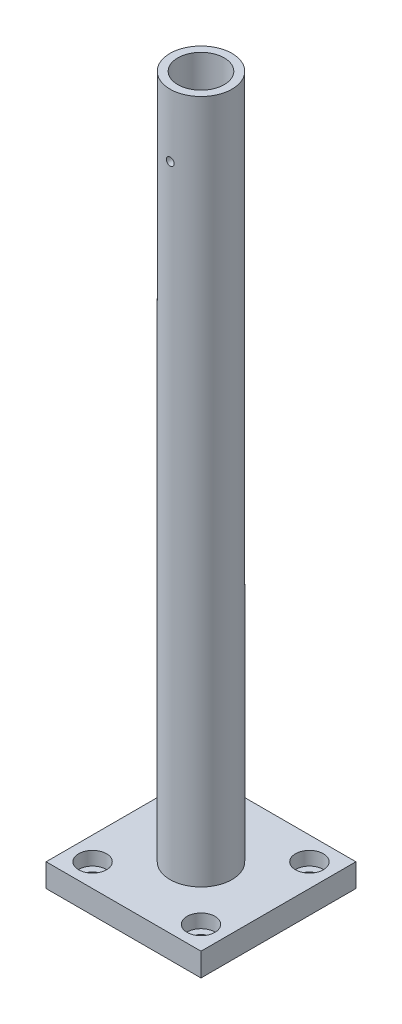
ISO-10303-21;
HEADER;
FILE_DESCRIPTION(('STEP AP214'),'2;1');
FILE_NAME('part.step','',(''),(''),'','','');
FILE_SCHEMA(('AUTOMOTIVE_DESIGN { 1 0 10303 214 1 1 1 1 }'));
ENDSEC;
DATA;
#1=APPLICATION_CONTEXT('core data for automotive mechanical design processes');
#2=APPLICATION_PROTOCOL_DEFINITION('international standard','automotive_design',2000,#1);
#3=PRODUCT_CONTEXT('',#1,'mechanical');
#4=PRODUCT('Part','Part','',(#3));
#5=PRODUCT_RELATED_PRODUCT_CATEGORY('part','',(#4));
#6=PRODUCT_DEFINITION_FORMATION('','',#4);
#7=PRODUCT_DEFINITION_CONTEXT('part definition',#1,'design');
#8=PRODUCT_DEFINITION('design','',#6,#7);
#9=PRODUCT_DEFINITION_SHAPE('','',#8);
#10=(LENGTH_UNIT() NAMED_UNIT(*) SI_UNIT(.MILLI.,.METRE.));
#11=(NAMED_UNIT(*) PLANE_ANGLE_UNIT() SI_UNIT($,.RADIAN.));
#12=(NAMED_UNIT(*) SI_UNIT($,.STERADIAN.) SOLID_ANGLE_UNIT());
#13=UNCERTAINTY_MEASURE_WITH_UNIT(LENGTH_MEASURE(1.E-05),#10,'distance_accuracy_value','');
#14=(GEOMETRIC_REPRESENTATION_CONTEXT(3) GLOBAL_UNCERTAINTY_ASSIGNED_CONTEXT((#13)) GLOBAL_UNIT_ASSIGNED_CONTEXT((#10,
#11,#12)) REPRESENTATION_CONTEXT('',''));
#15=CARTESIAN_POINT('',(0.,0.,0.));
#16=DIRECTION('',(0.,0.,1.));
#17=DIRECTION('',(1.,0.,0.));
#18=AXIS2_PLACEMENT_3D('',#15,#16,#17);
#19=CARTESIAN_POINT('',(15.,-319.,-85.));
#20=DIRECTION('',(0.,1.,0.));
#21=DIRECTION('',(0.,0.,1.));
#22=AXIS2_PLACEMENT_3D('',#19,#20,#21);
#23=CYLINDRICAL_SURFACE('',#22,4.50000000000001);
#24=CARTESIAN_POINT('',(15.,0.,-85.));
#25=DIRECTION('',(0.,-1.,0.));
#26=DIRECTION('',(0.,0.,-1.));
#27=AXIS2_PLACEMENT_3D('',#24,#25,#26);
#28=CIRCLE('',#27,4.50000000000001);
#29=CARTESIAN_POINT('',(15.,0.,-89.5));
#30=VERTEX_POINT('',#29);
#31=EDGE_CURVE('E199',#30,#30,#28,.T.);
#32=ORIENTED_EDGE('',*,*,#31,.T.);
#33=EDGE_LOOP('',(#32));
#34=FACE_BOUND('',#33,.T.);
#35=CARTESIAN_POINT('',(15.,6.19999999999998,-85.));
#36=DIRECTION('',(0.,1.,0.));
#37=DIRECTION('',(0.,0.,1.));
#38=AXIS2_PLACEMENT_3D('',#35,#36,#37);
#39=CIRCLE('',#38,4.50000000000001);
#40=CARTESIAN_POINT('',(15.,6.19999999999998,-80.5));
#41=VERTEX_POINT('',#40);
#42=EDGE_CURVE('E43',#41,#41,#39,.F.);
#43=ORIENTED_EDGE('',*,*,#42,.F.);
#44=EDGE_LOOP('',(#43));
#45=FACE_BOUND('',#44,.T.);
#46=ADVANCED_FACE('F39',(#34,#45),#23,.F.);
#47=CARTESIAN_POINT('',(85.,-319.,-85.));
#48=DIRECTION('',(0.,1.,0.));
#49=DIRECTION('',(0.,0.,1.));
#50=AXIS2_PLACEMENT_3D('',#47,#48,#49);
#51=CYLINDRICAL_SURFACE('',#50,4.50000000000001);
#52=CARTESIAN_POINT('',(85.,0.,-85.));
#53=DIRECTION('',(0.,-1.,0.));
#54=DIRECTION('',(0.,0.,-1.));
#55=AXIS2_PLACEMENT_3D('',#52,#53,#54);
#56=CIRCLE('',#55,4.50000000000001);
#57=CARTESIAN_POINT('',(85.,0.,-89.5));
#58=VERTEX_POINT('',#57);
#59=EDGE_CURVE('E204',#58,#58,#56,.T.);
#60=ORIENTED_EDGE('',*,*,#59,.T.);
#61=EDGE_LOOP('',(#60));
#62=FACE_BOUND('',#61,.T.);
#63=CARTESIAN_POINT('',(85.,6.19999999999998,-85.));
#64=DIRECTION('',(0.,1.,0.));
#65=DIRECTION('',(0.,0.,1.));
#66=AXIS2_PLACEMENT_3D('',#63,#64,#65);
#67=CIRCLE('',#66,4.50000000000001);
#68=CARTESIAN_POINT('',(85.,6.19999999999998,-80.5));
#69=VERTEX_POINT('',#68);
#70=EDGE_CURVE('E203',#69,#69,#67,.F.);
#71=ORIENTED_EDGE('',*,*,#70,.F.);
#72=EDGE_LOOP('',(#71));
#73=FACE_BOUND('',#72,.T.);
#74=ADVANCED_FACE('F188',(#62,#73),#51,.F.);
#75=CARTESIAN_POINT('',(85.,-319.,-15.));
#76=DIRECTION('',(0.,1.,0.));
#77=DIRECTION('',(0.,0.,1.));
#78=AXIS2_PLACEMENT_3D('',#75,#76,#77);
#79=CYLINDRICAL_SURFACE('',#78,4.5);
#80=CARTESIAN_POINT('',(85.,0.,-15.));
#81=DIRECTION('',(0.,-1.,0.));
#82=DIRECTION('',(0.,0.,-1.));
#83=AXIS2_PLACEMENT_3D('',#80,#81,#82);
#84=CIRCLE('',#83,4.5);
#85=CARTESIAN_POINT('',(85.,0.,-19.5));
#86=VERTEX_POINT('',#85);
#87=EDGE_CURVE('E218',#86,#86,#84,.T.);
#88=ORIENTED_EDGE('',*,*,#87,.T.);
#89=EDGE_LOOP('',(#88));
#90=FACE_BOUND('',#89,.T.);
#91=CARTESIAN_POINT('',(85.,6.19999999999998,-15.));
#92=DIRECTION('',(0.,1.,0.));
#93=DIRECTION('',(0.,0.,1.));
#94=AXIS2_PLACEMENT_3D('',#91,#92,#93);
#95=CIRCLE('',#94,4.5);
#96=CARTESIAN_POINT('',(85.,6.19999999999998,-10.5));
#97=VERTEX_POINT('',#96);
#98=EDGE_CURVE('E206',#97,#97,#95,.F.);
#99=ORIENTED_EDGE('',*,*,#98,.F.);
#100=EDGE_LOOP('',(#99));
#101=FACE_BOUND('',#100,.T.);
#102=ADVANCED_FACE('F193',(#90,#101),#79,.F.);
#103=CARTESIAN_POINT('',(15.,-319.,-15.));
#104=DIRECTION('',(0.,1.,0.));
#105=DIRECTION('',(0.,0.,1.));
#106=AXIS2_PLACEMENT_3D('',#103,#104,#105);
#107=CYLINDRICAL_SURFACE('',#106,4.5);
#108=CARTESIAN_POINT('',(15.,0.,-15.));
#109=DIRECTION('',(0.,-1.,0.));
#110=DIRECTION('',(0.,0.,-1.));
#111=AXIS2_PLACEMENT_3D('',#108,#109,#110);
#112=CIRCLE('',#111,4.5);
#113=CARTESIAN_POINT('',(15.,0.,-19.5));
#114=VERTEX_POINT('',#113);
#115=EDGE_CURVE('E127',#114,#114,#112,.T.);
#116=ORIENTED_EDGE('',*,*,#115,.T.);
#117=EDGE_LOOP('',(#116));
#118=FACE_BOUND('',#117,.T.);
#119=CARTESIAN_POINT('',(15.,6.19999999999998,-15.));
#120=DIRECTION('',(0.,1.,0.));
#121=DIRECTION('',(0.,0.,1.));
#122=AXIS2_PLACEMENT_3D('',#119,#120,#121);
#123=CIRCLE('',#122,4.5);
#124=CARTESIAN_POINT('',(15.,6.19999999999998,-10.5));
#125=VERTEX_POINT('',#124);
#126=EDGE_CURVE('E210',#125,#125,#123,.F.);
#127=ORIENTED_EDGE('',*,*,#126,.F.);
#128=EDGE_LOOP('',(#127));
#129=FACE_BOUND('',#128,.T.);
#130=ADVANCED_FACE('F185',(#118,#129),#107,.F.);
#131=CARTESIAN_POINT('',(0.,15.,0.));
#132=DIRECTION('',(1.,0.,0.));
#133=DIRECTION('',(0.,0.,-1.));
#134=AXIS2_PLACEMENT_3D('',#131,#132,#133);
#135=PLANE('',#134);
#136=DIRECTION('',(0.,0.,1.));
#137=VECTOR('',#136,1.);
#138=CARTESIAN_POINT('',(0.,0.,0.));
#139=LINE('',#138,#137);
#140=CARTESIAN_POINT('',(0.,0.,-100.));
#141=VERTEX_POINT('',#140);
#142=CARTESIAN_POINT('',(0.,0.,0.));
#143=VERTEX_POINT('',#142);
#144=EDGE_CURVE('E108',#141,#143,#139,.T.);
#145=ORIENTED_EDGE('',*,*,#144,.T.);
#146=DIRECTION('',(0.,-1.,0.));
#147=VECTOR('',#146,1.);
#148=CARTESIAN_POINT('',(0.,15.,0.));
#149=LINE('',#148,#147);
#150=CARTESIAN_POINT('',(0.,15.,0.));
#151=VERTEX_POINT('',#150);
#152=EDGE_CURVE('E49',#151,#143,#149,.T.);
#153=ORIENTED_EDGE('',*,*,#152,.F.);
#154=DIRECTION('',(0.,0.,1.));
#155=VECTOR('',#154,1.);
#156=CARTESIAN_POINT('',(0.,15.,0.));
#157=LINE('',#156,#155);
#158=CARTESIAN_POINT('',(0.,15.,-100.));
#159=VERTEX_POINT('',#158);
#160=EDGE_CURVE('E94',#159,#151,#157,.T.);
#161=ORIENTED_EDGE('',*,*,#160,.F.);
#162=DIRECTION('',(0.,-1.,0.));
#163=VECTOR('',#162,1.);
#164=CARTESIAN_POINT('',(0.,15.,-100.));
#165=LINE('',#164,#163);
#166=EDGE_CURVE('E104',#159,#141,#165,.T.);
#167=ORIENTED_EDGE('',*,*,#166,.T.);
#168=EDGE_LOOP('',(#145,#153,#161,#167));
#169=FACE_BOUND('',#168,.T.);
#170=ADVANCED_FACE('F41',(#169),#135,.F.);
#171=CARTESIAN_POINT('',(0.,15.,0.));
#172=DIRECTION('',(0.,0.,-1.));
#173=DIRECTION('',(-1.,0.,0.));
#174=AXIS2_PLACEMENT_3D('',#171,#172,#173);
#175=PLANE('',#174);
#176=DIRECTION('',(1.,0.,0.));
#177=VECTOR('',#176,1.);
#178=CARTESIAN_POINT('',(0.,0.,0.));
#179=LINE('',#178,#177);
#180=CARTESIAN_POINT('',(100.,0.,0.));
#181=VERTEX_POINT('',#180);
#182=EDGE_CURVE('E99',#143,#181,#179,.T.);
#183=ORIENTED_EDGE('',*,*,#182,.T.);
#184=DIRECTION('',(0.,-1.,0.));
#185=VECTOR('',#184,1.);
#186=CARTESIAN_POINT('',(100.,15.,0.));
#187=LINE('',#186,#185);
#188=CARTESIAN_POINT('',(100.,15.,0.));
#189=VERTEX_POINT('',#188);
#190=EDGE_CURVE('E97',#189,#181,#187,.T.);
#191=ORIENTED_EDGE('',*,*,#190,.F.);
#192=DIRECTION('',(1.,0.,0.));
#193=VECTOR('',#192,1.);
#194=CARTESIAN_POINT('',(0.,15.,0.));
#195=LINE('',#194,#193);
#196=EDGE_CURVE('E89',#151,#189,#195,.T.);
#197=ORIENTED_EDGE('',*,*,#196,.F.);
#198=ORIENTED_EDGE('',*,*,#152,.T.);
#199=EDGE_LOOP('',(#183,#191,#197,#198));
#200=FACE_BOUND('',#199,.T.);
#201=ADVANCED_FACE('F98',(#200),#175,.F.);
#202=CARTESIAN_POINT('',(100.,15.,0.));
#203=DIRECTION('',(-1.,0.,0.));
#204=DIRECTION('',(0.,0.,1.));
#205=AXIS2_PLACEMENT_3D('',#202,#203,#204);
#206=PLANE('',#205);
#207=DIRECTION('',(0.,0.,-1.));
#208=VECTOR('',#207,1.);
#209=CARTESIAN_POINT('',(100.,0.,0.));
#210=LINE('',#209,#208);
#211=CARTESIAN_POINT('',(100.,0.,-100.));
#212=VERTEX_POINT('',#211);
#213=EDGE_CURVE('E75',#181,#212,#210,.T.);
#214=ORIENTED_EDGE('',*,*,#213,.T.);
#215=DIRECTION('',(0.,-1.,0.));
#216=VECTOR('',#215,1.);
#217=CARTESIAN_POINT('',(100.,15.,-100.));
#218=LINE('',#217,#216);
#219=CARTESIAN_POINT('',(100.,15.,-100.));
#220=VERTEX_POINT('',#219);
#221=EDGE_CURVE('E100',#220,#212,#218,.T.);
#222=ORIENTED_EDGE('',*,*,#221,.F.);
#223=DIRECTION('',(0.,0.,-1.));
#224=VECTOR('',#223,1.);
#225=CARTESIAN_POINT('',(100.,15.,0.));
#226=LINE('',#225,#224);
#227=EDGE_CURVE('E92',#189,#220,#226,.T.);
#228=ORIENTED_EDGE('',*,*,#227,.F.);
#229=ORIENTED_EDGE('',*,*,#190,.T.);
#230=EDGE_LOOP('',(#214,#222,#228,#229));
#231=FACE_BOUND('',#230,.T.);
#232=ADVANCED_FACE('F102',(#231),#206,.F.);
#233=CARTESIAN_POINT('',(0.,15.,-100.));
#234=DIRECTION('',(0.,0.,1.));
#235=DIRECTION('',(1.,0.,0.));
#236=AXIS2_PLACEMENT_3D('',#233,#234,#235);
#237=PLANE('',#236);
#238=DIRECTION('',(-1.,0.,0.));
#239=VECTOR('',#238,1.);
#240=CARTESIAN_POINT('',(0.,0.,-100.));
#241=LINE('',#240,#239);
#242=EDGE_CURVE('E81',#212,#141,#241,.T.);
#243=ORIENTED_EDGE('',*,*,#242,.T.);
#244=ORIENTED_EDGE('',*,*,#166,.F.);
#245=DIRECTION('',(-1.,0.,0.));
#246=VECTOR('',#245,1.);
#247=CARTESIAN_POINT('',(0.,15.,-100.));
#248=LINE('',#247,#246);
#249=EDGE_CURVE('E58',#220,#159,#248,.T.);
#250=ORIENTED_EDGE('',*,*,#249,.F.);
#251=ORIENTED_EDGE('',*,*,#221,.T.);
#252=EDGE_LOOP('',(#243,#244,#250,#251));
#253=FACE_BOUND('',#252,.T.);
#254=ADVANCED_FACE('F172',(#253),#237,.F.);
#255=CARTESIAN_POINT('',(0.,15.,0.));
#256=DIRECTION('',(0.,-1.,0.));
#257=DIRECTION('',(0.,0.,-1.));
#258=AXIS2_PLACEMENT_3D('',#255,#256,#257);
#259=PLANE('',#258);
#260=CARTESIAN_POINT('',(15.,15.,-15.));
#261=DIRECTION('',(0.,1.,0.));
#262=DIRECTION('',(0.,0.,1.));
#263=AXIS2_PLACEMENT_3D('',#260,#261,#262);
#264=CIRCLE('',#263,9.);
#265=CARTESIAN_POINT('',(15.,15.,-6.));
#266=VERTEX_POINT('',#265);
#267=EDGE_CURVE('E460',#266,#266,#264,.T.);
#268=ORIENTED_EDGE('',*,*,#267,.F.);
#269=EDGE_LOOP('',(#268));
#270=FACE_BOUND('',#269,.T.);
#271=CARTESIAN_POINT('',(85.,15.,-15.));
#272=DIRECTION('',(0.,1.,0.));
#273=DIRECTION('',(0.,0.,1.));
#274=AXIS2_PLACEMENT_3D('',#271,#272,#273);
#275=CIRCLE('',#274,9.);
#276=CARTESIAN_POINT('',(85.,15.,-6.));
#277=VERTEX_POINT('',#276);
#278=EDGE_CURVE('E454',#277,#277,#275,.T.);
#279=ORIENTED_EDGE('',*,*,#278,.F.);
#280=EDGE_LOOP('',(#279));
#281=FACE_BOUND('',#280,.T.);
#282=CARTESIAN_POINT('',(85.,15.,-85.));
#283=DIRECTION('',(0.,1.,0.));
#284=DIRECTION('',(0.,0.,1.));
#285=AXIS2_PLACEMENT_3D('',#282,#283,#284);
#286=CIRCLE('',#285,8.99999999999999);
#287=CARTESIAN_POINT('',(85.,15.,-76.));
#288=VERTEX_POINT('',#287);
#289=EDGE_CURVE('E445',#288,#288,#286,.T.);
#290=ORIENTED_EDGE('',*,*,#289,.F.);
#291=EDGE_LOOP('',(#290));
#292=FACE_BOUND('',#291,.T.);
#293=CARTESIAN_POINT('',(15.,15.,-85.));
#294=DIRECTION('',(0.,1.,0.));
#295=DIRECTION('',(0.,0.,1.));
#296=AXIS2_PLACEMENT_3D('',#293,#294,#295);
#297=CIRCLE('',#296,9.00000000000001);
#298=CARTESIAN_POINT('',(15.,15.,-76.));
#299=VERTEX_POINT('',#298);
#300=EDGE_CURVE('E156',#299,#299,#297,.T.);
#301=ORIENTED_EDGE('',*,*,#300,.F.);
#302=EDGE_LOOP('',(#301));
#303=FACE_BOUND('',#302,.T.);
#304=CARTESIAN_POINT('',(50.,15.,-50.));
#305=DIRECTION('',(0.,-1.,0.));
#306=DIRECTION('',(0.,0.,-1.));
#307=AXIS2_PLACEMENT_3D('',#304,#305,#306);
#308=CIRCLE('',#307,20.);
#309=CARTESIAN_POINT('',(50.,15.,-70.));
#310=VERTEX_POINT('',#309);
#311=EDGE_CURVE('E11',#310,#310,#308,.F.);
#312=ORIENTED_EDGE('',*,*,#311,.F.);
#313=EDGE_LOOP('',(#312));
#314=FACE_BOUND('',#313,.T.);
#315=ORIENTED_EDGE('',*,*,#160,.T.);
#316=ORIENTED_EDGE('',*,*,#196,.T.);
#317=ORIENTED_EDGE('',*,*,#227,.T.);
#318=ORIENTED_EDGE('',*,*,#249,.T.);
#319=EDGE_LOOP('',(#315,#316,#317,#318));
#320=FACE_BOUND('',#319,.T.);
#321=ADVANCED_FACE('F90',(#270,#281,#292,#303,#314,#320),#259,.F.);
#322=CARTESIAN_POINT('',(0.,0.,0.));
#323=DIRECTION('',(0.,-1.,0.));
#324=DIRECTION('',(0.,0.,-1.));
#325=AXIS2_PLACEMENT_3D('',#322,#323,#324);
#326=PLANE('',#325);
#327=ORIENTED_EDGE('',*,*,#115,.F.);
#328=EDGE_LOOP('',(#327));
#329=FACE_BOUND('',#328,.T.);
#330=ORIENTED_EDGE('',*,*,#87,.F.);
#331=EDGE_LOOP('',(#330));
#332=FACE_BOUND('',#331,.T.);
#333=ORIENTED_EDGE('',*,*,#59,.F.);
#334=EDGE_LOOP('',(#333));
#335=FACE_BOUND('',#334,.T.);
#336=ORIENTED_EDGE('',*,*,#31,.F.);
#337=EDGE_LOOP('',(#336));
#338=FACE_BOUND('',#337,.T.);
#339=ORIENTED_EDGE('',*,*,#144,.F.);
#340=ORIENTED_EDGE('',*,*,#242,.F.);
#341=ORIENTED_EDGE('',*,*,#213,.F.);
#342=ORIENTED_EDGE('',*,*,#182,.F.);
#343=EDGE_LOOP('',(#339,#340,#341,#342));
#344=FACE_BOUND('',#343,.T.);
#345=ADVANCED_FACE('F171',(#329,#332,#335,#338,#344),#326,.T.);
#346=CARTESIAN_POINT('',(50.,457.,-50.));
#347=DIRECTION('',(0.,1.,0.));
#348=DIRECTION('',(0.,0.,1.));
#349=AXIS2_PLACEMENT_3D('',#346,#347,#348);
#350=PLANE('',#349);
#351=CARTESIAN_POINT('',(50.,457.,-50.));
#352=DIRECTION('',(0.,1.,0.));
#353=DIRECTION('',(0.,0.,1.));
#354=AXIS2_PLACEMENT_3D('',#351,#352,#353);
#355=CIRCLE('',#354,20.);
#356=CARTESIAN_POINT('',(50.,457.,-30.));
#357=VERTEX_POINT('',#356);
#358=EDGE_CURVE('E111',#357,#357,#355,.T.);
#359=ORIENTED_EDGE('',*,*,#358,.T.);
#360=EDGE_LOOP('',(#359));
#361=FACE_BOUND('',#360,.T.);
#362=CARTESIAN_POINT('',(50.,457.,-50.));
#363=DIRECTION('',(0.,1.,0.));
#364=DIRECTION('',(0.,0.,1.));
#365=AXIS2_PLACEMENT_3D('',#362,#363,#364);
#366=CIRCLE('',#365,15.);
#367=CARTESIAN_POINT('',(50.,457.,-35.));
#368=VERTEX_POINT('',#367);
#369=EDGE_CURVE('E231',#368,#368,#366,.T.);
#370=ORIENTED_EDGE('',*,*,#369,.F.);
#371=EDGE_LOOP('',(#370));
#372=FACE_BOUND('',#371,.T.);
#373=ADVANCED_FACE('F166',(#361,#372),#350,.T.);
#374=CARTESIAN_POINT('',(50.,457.,-50.));
#375=DIRECTION('',(0.,-1.,0.));
#376=DIRECTION('',(0.,0.,-1.));
#377=AXIS2_PLACEMENT_3D('',#374,#375,#376);
#378=CYLINDRICAL_SURFACE('',#377,20.);
#379=CARTESIAN_POINT('',(50.,419.,-70.));
#380=CARTESIAN_POINT('',(49.8601589044442,418.999994059064,-69.9999980489643));
#381=CARTESIAN_POINT('',(49.7202304256973,418.988227120831,-69.998517845549));
#382=CARTESIAN_POINT('',(49.4442671979102,418.941472245429,-69.9927554011136));
#383=CARTESIAN_POINT('',(49.3082366693763,418.906460062077,-69.9884702344143));
#384=CARTESIAN_POINT('',(49.044104425187,418.814262356086,-69.9775806104441));
#385=CARTESIAN_POINT('',(48.9159974398539,418.75709175819,-69.9709777145554));
#386=CARTESIAN_POINT('',(48.671220525107,418.62223271603,-69.956187008781));
#387=CARTESIAN_POINT('',(48.5545486384437,418.544547791469,-69.9479994708412));
#388=CARTESIAN_POINT('',(48.3352871830687,418.37040805016,-69.9309032130633));
#389=CARTESIAN_POINT('',(48.2327696350629,418.273862870654,-69.9219911469242));
#390=CARTESIAN_POINT('',(48.0453472064425,418.064937176463,-69.9044772600975));
#391=CARTESIAN_POINT('',(47.9604432236078,417.952555855087,-69.8958754552427));
#392=CARTESIAN_POINT('',(47.8103898387161,417.714680022434,-69.8799230561958));
#393=CARTESIAN_POINT('',(47.7453079040589,417.589142638432,-69.8725767717791));
#394=CARTESIAN_POINT('',(47.6371769234249,417.328812948053,-69.8600112845768));
#395=CARTESIAN_POINT('',(47.5941270419348,417.194020992853,-69.8547920011314));
#396=CARTESIAN_POINT('',(47.5315010199752,416.919755804413,-69.8471033960361));
#397=CARTESIAN_POINT('',(47.5118032852683,416.780310742296,-69.8446198343675));
#398=CARTESIAN_POINT('',(47.4960644504428,416.500073736528,-69.8426402814279));
#399=CARTESIAN_POINT('',(47.5000223989976,416.359281847269,-69.8431441700151));
#400=CARTESIAN_POINT('',(47.5313827635521,416.081195172751,-69.8470695536975));
#401=CARTESIAN_POINT('',(47.5586512370153,415.9438850138,-69.8504743796033));
#402=CARTESIAN_POINT('',(47.6356496168179,415.675804978781,-69.8597919975763));
#403=CARTESIAN_POINT('',(47.6853799782481,415.545035235286,-69.8657048404572));
#404=CARTESIAN_POINT('',(47.8060344400883,415.293332000978,-69.8793911586465));
#405=CARTESIAN_POINT('',(47.8770167462924,415.172426699751,-69.8871697321145));
#406=CARTESIAN_POINT('',(48.0381185305431,414.944193305587,-69.903707114306));
#407=CARTESIAN_POINT('',(48.1282388839192,414.836865834026,-69.9124659678566));
#408=CARTESIAN_POINT('',(48.3258008892462,414.638057289277,-69.9300510989043));
#409=CARTESIAN_POINT('',(48.43335799216,414.546690908234,-69.9388774238689));
#410=CARTESIAN_POINT('',(48.6623428308861,414.383291119969,-69.9555463255585));
#411=CARTESIAN_POINT('',(48.7837705986818,414.311257757328,-69.9633889000151));
#412=CARTESIAN_POINT('',(49.0371383286365,414.188568679536,-69.9772115221858));
#413=CARTESIAN_POINT('',(49.1690818046623,414.137920146119,-69.9831909440154));
#414=CARTESIAN_POINT('',(49.4396920595689,414.059529506477,-69.9926078578006));
#415=CARTESIAN_POINT('',(49.5783585233693,414.031786327863,-69.9960454687587));
#416=CARTESIAN_POINT('',(49.8574868360865,414.000142575739,-69.9999759641076));
#417=CARTESIAN_POINT('',(49.9979305098014,413.996084007636,-70.0004883614264));
#418=CARTESIAN_POINT('',(50.2774960364975,414.011507734056,-69.9985633800543));
#419=CARTESIAN_POINT('',(50.4166179175647,414.030989527252,-69.9961260641821));
#420=CARTESIAN_POINT('',(50.6891245077215,414.092809708774,-69.9885876875669));
#421=CARTESIAN_POINT('',(50.8225265704247,414.135072763403,-69.9834954081387));
#422=CARTESIAN_POINT('',(51.0803496548584,414.241177451913,-69.971217231002));
#423=CARTESIAN_POINT('',(51.2047703714653,414.305019818491,-69.9640312622062));
#424=CARTESIAN_POINT('',(51.4418045206874,414.452853137507,-69.9483182291011));
#425=CARTESIAN_POINT('',(51.5543537599438,414.536946289806,-69.9397844404251));
#426=CARTESIAN_POINT('',(51.7637969896263,414.722749497534,-69.9223514232566));
#427=CARTESIAN_POINT('',(51.8606903583369,414.824460252251,-69.913452180269));
#428=CARTESIAN_POINT('',(52.036631958818,415.043307416757,-69.8962310546258));
#429=CARTESIAN_POINT('',(52.1155754605679,415.16052834631,-69.8879127472133));
#430=CARTESIAN_POINT('',(52.2526528894435,415.406658244855,-69.8728541103715));
#431=CARTESIAN_POINT('',(52.3107872337284,415.535566979477,-69.8661137493103));
#432=CARTESIAN_POINT('',(52.4044265788665,415.801075319148,-69.8549985039299));
#433=CARTESIAN_POINT('',(52.4399906274571,415.937653830048,-69.8506174518479));
#434=CARTESIAN_POINT('',(52.4876699938678,416.214902483781,-69.8446991590746));
#435=CARTESIAN_POINT('',(52.4997864025358,416.355572435959,-69.8431617860878));
#436=CARTESIAN_POINT('',(52.5002065360848,416.635968929205,-69.8431087698246));
#437=CARTESIAN_POINT('',(52.4886747976993,416.775695248332,-69.8445722475195));
#438=CARTESIAN_POINT('',(52.4424744048493,417.051207129345,-69.850311145372));
#439=CARTESIAN_POINT('',(52.4078057479058,417.186992690809,-69.8545865658308));
#440=CARTESIAN_POINT('',(52.3163670736896,417.450746956766,-69.8654611577455));
#441=CARTESIAN_POINT('',(52.2596049809709,417.578718445022,-69.8720594959278));
#442=CARTESIAN_POINT('',(52.1256069021503,417.823346654048,-69.8868378324482));
#443=CARTESIAN_POINT('',(52.0483706595096,417.94000323302,-69.8950178506041));
#444=CARTESIAN_POINT('',(51.8750063312658,418.159531225341,-69.9121060475223));
#445=CARTESIAN_POINT('',(51.778755625775,418.262305460955,-69.9210187208404));
#446=CARTESIAN_POINT('',(51.5703502269684,418.450306825168,-69.938528315929));
#447=CARTESIAN_POINT('',(51.4581917891416,418.535529810774,-69.9471251627559));
#448=CARTESIAN_POINT('',(51.2206656208542,418.686285357105,-69.9630705658675));
#449=CARTESIAN_POINT('',(51.0952492795962,418.751741805899,-69.970414250783));
#450=CARTESIAN_POINT('',(50.8351829023013,418.860571242916,-69.9829764907673));
#451=CARTESIAN_POINT('',(50.7005430808703,418.903968226353,-69.9881973536958));
#452=CARTESIAN_POINT('',(50.4710057719679,418.957059338171,-69.9946672032775));
#453=CARTESIAN_POINT('',(50.3775556635169,418.973138941982,-69.9966572589545));
#454=CARTESIAN_POINT('',(50.1894170632124,418.994611245693,-69.9993243132919));
#455=CARTESIAN_POINT('',(50.094728580496,419.000004024399,-70.0000013216347));
#456=CARTESIAN_POINT('',(50.,419.,-70.));
#457=B_SPLINE_CURVE_WITH_KNOTS('',3,(#379,#380,#381,#382,#383,#384,#385,#386,#387,#388,#389,
#390,#391,#392,#393,#394,#395,#396,#397,#398,#399,#400,#401,#402,#403,#404,#405,#406,#407,#408,
#409,#410,#411,#412,#413,#414,#415,#416,#417,#418,#419,#420,#421,#422,#423,#424,#425,#426,#427,
#428,#429,#430,#431,#432,#433,#434,#435,#436,#437,#438,#439,#440,#441,#442,#443,#444,#445,#446,
#447,#448,#449,#450,#451,#452,#453,#454,#455,#456),.UNSPECIFIED.,.T.,.F.,(4,2,2,2,2,2,2,2,2,2,2,
2,2,2,2,2,2,2,2,2,2,2,2,2,2,2,2,2,2,2,2,2,2,2,2,2,2,2,4),(0.,0.419177272776253,0.83879246094341,
1.25812550818172,1.67738665591068,2.09870813201849,2.52005107800009,2.94281250318875,
3.36555789496806,3.78609225286319,4.20660969884663,4.62472696441686,5.04285270166235,
5.46213426285528,5.88143500513636,6.30363478136414,6.72583553113116,7.14817795731604,
7.57050060903778,7.99000279391918,8.40949604501927,8.82761053893396,9.24573923078945,
9.66602402928419,10.0863255137509,10.5090197150757,10.9317054422153,11.3532807428092,
11.7748364301062,12.1934690120221,12.6121016387955,13.0305842470648,13.4490720991226,
13.8703523769183,14.2917319847001,14.7147140303685,15.1372349868403,15.4211884318763,
15.7051397830044),.UNSPECIFIED.);
#458=CARTESIAN_POINT('',(50.,419.,-70.));
#459=VERTEX_POINT('',#458);
#460=EDGE_CURVE('E155',#459,#459,#457,.T.);
#461=ORIENTED_EDGE('',*,*,#460,.T.);
#462=EDGE_LOOP('',(#461));
#463=FACE_BOUND('',#462,.T.);
#464=CARTESIAN_POINT('',(52.5,416.5,-30.1568651670156));
#465=CARTESIAN_POINT('',(52.4999940548334,416.3601637162,-30.1568631585327));
#466=CARTESIAN_POINT('',(52.4882278990166,416.220240035069,-30.1553710500112));
#467=CARTESIAN_POINT('',(52.4414764137167,415.944286774572,-30.1495660914458));
#468=CARTESIAN_POINT('',(52.4064668210908,415.808261419498,-30.1452502939041));
#469=CARTESIAN_POINT('',(52.3142766928277,415.544140117892,-30.1342942619124));
#470=CARTESIAN_POINT('',(52.2571112047987,415.416038857884,-30.1276556053742));
#471=CARTESIAN_POINT('',(52.122264198429,415.171271548175,-30.1128037648902));
#472=CARTESIAN_POINT('',(52.0445861873746,415.054603548256,-30.1045908501811));
#473=CARTESIAN_POINT('',(51.8704534502645,414.835337752878,-30.0874644075369));
#474=CARTESIAN_POINT('',(51.7739068150243,414.732813197681,-30.0785475829731));
#475=CARTESIAN_POINT('',(51.5649752606711,414.545377231061,-30.0610476712481));
#476=CARTESIAN_POINT('',(51.452589554058,414.460466695905,-30.0524646007079));
#477=CARTESIAN_POINT('',(51.214709830676,414.310406420494,-30.03656555387));
#478=CARTESIAN_POINT('',(51.0891736955611,414.2453229549,-30.0292538615315));
#479=CARTESIAN_POINT('',(50.8288467180559,414.137188800059,-30.0167576304552));
#480=CARTESIAN_POINT('',(50.6940562193609,414.094137293074,-30.0115730127704));
#481=CARTESIAN_POINT('',(50.4197956877511,414.031507931666,-30.0039383129376));
#482=CARTESIAN_POINT('',(50.2803538596634,414.011808321476,-30.0014740516406));
#483=CARTESIAN_POINT('',(50.0001232006865,413.996064614963,-29.9995093027079));
#484=CARTESIAN_POINT('',(49.8593344230052,414.000019588048,-30.0000086984792));
#485=CARTESIAN_POINT('',(49.5812347310254,414.031375202757,-30.0039035222999));
#486=CARTESIAN_POINT('',(49.4439087942355,414.058644898481,-30.0072827754427));
#487=CARTESIAN_POINT('',(49.1757978360946,414.13565117663,-30.0165394405767));
#488=CARTESIAN_POINT('',(49.0450129391438,414.185388186167,-30.0224169000595));
#489=CARTESIAN_POINT('',(48.7932911845613,414.306056492784,-30.0360374219209));
#490=CARTESIAN_POINT('',(48.6723817721594,414.37704445773,-30.0437854615676));
#491=CARTESIAN_POINT('',(48.4441425476935,414.538158362216,-30.0602803093472));
#492=CARTESIAN_POINT('',(48.3368133587826,414.628285179469,-30.0690271632774));
#493=CARTESIAN_POINT('',(48.138011969227,414.825851818598,-30.0866113247649));
#494=CARTESIAN_POINT('',(48.046653160004,414.933405759547,-30.0954488419527));
#495=CARTESIAN_POINT('',(47.8832671493749,415.162381556783,-30.1121592805942));
#496=CARTESIAN_POINT('',(47.8112400085649,415.283803456538,-30.1200321990242));
#497=CARTESIAN_POINT('',(47.6885554264172,415.537169495562,-30.1339219738728));
#498=CARTESIAN_POINT('',(47.6379070701377,415.669118079953,-30.1399380409187));
#499=CARTESIAN_POINT('',(47.5595183455319,415.939739453527,-30.1494175750404));
#500=CARTESIAN_POINT('',(47.5317768732004,416.078411918309,-30.152881165133));
#501=CARTESIAN_POINT('',(47.5001395680914,416.357543182,-30.1568411121595));
#502=CARTESIAN_POINT('',(47.4960841580017,416.497983623089,-30.1573573255762));
#503=CARTESIAN_POINT('',(47.5115130467694,416.777541929665,-30.1554165888035));
#504=CARTESIAN_POINT('',(47.5309968438902,416.916659823279,-30.1529597019855));
#505=CARTESIAN_POINT('',(47.5928167142023,417.189145763578,-30.1453677151601));
#506=CARTESIAN_POINT('',(47.635075516254,417.32253161519,-30.1402416730534));
#507=CARTESIAN_POINT('',(47.7411662808839,417.580324154853,-30.1278963002919));
#508=CARTESIAN_POINT('',(47.8049990014188,417.704730527241,-30.1206768960924));
#509=CARTESIAN_POINT('',(47.9528179778451,417.941754643813,-30.1049106864677));
#510=CARTESIAN_POINT('',(48.036908880423,418.054306665315,-30.0963570726292));
#511=CARTESIAN_POINT('',(48.2227092576311,418.263756553935,-30.0789076044898));
#512=CARTESIAN_POINT('',(48.3244194175746,418.360653811868,-30.0700117368871));
#513=CARTESIAN_POINT('',(48.5432682244415,418.536604187334,-30.0528191131304));
#514=CARTESIAN_POINT('',(48.660491507883,418.615552446795,-30.0445260608748));
#515=CARTESIAN_POINT('',(48.9066274183182,418.752638217634,-30.0295288696839));
#516=CARTESIAN_POINT('',(49.0355398096317,418.810776148481,-30.0228246987228));
#517=CARTESIAN_POINT('',(49.3010461408606,418.904417786908,-30.0117770934681));
#518=CARTESIAN_POINT('',(49.4376184334882,418.939982096032,-30.007427343123));
#519=CARTESIAN_POINT('',(49.7148539427221,418.987664089227,-30.0015524532243));
#520=CARTESIAN_POINT('',(49.8555169745619,418.999782830599,-30.0000271862981));
#521=CARTESIAN_POINT('',(50.1359171833438,419.000209922292,-29.9999737198635));
#522=CARTESIAN_POINT('',(50.2756541377148,418.988679960568,-30.001425168322));
#523=CARTESIAN_POINT('',(50.5511877414527,418.942479386569,-30.0071215884202));
#524=CARTESIAN_POINT('',(50.6869843935599,418.907808790388,-30.0113665581171));
#525=CARTESIAN_POINT('',(50.9507614429873,418.81636188565,-30.0221751478811));
#526=CARTESIAN_POINT('',(51.0787445601595,418.759593320627,-30.0287379556607));
#527=CARTESIAN_POINT('',(51.3233933371442,418.625578685392,-30.0434555239318));
#528=CARTESIAN_POINT('',(51.4400588623885,418.548332371737,-30.0516103033488));
#529=CARTESIAN_POINT('',(51.6595867679622,418.374956784665,-30.0686680607644));
#530=CARTESIAN_POINT('',(51.7623537878328,418.27870720648,-30.0775755872863));
#531=CARTESIAN_POINT('',(51.9503411188209,418.070307055968,-30.0950984097891));
#532=CARTESIAN_POINT('',(52.0355572677992,417.958152722497,-30.1037136360482));
#533=CARTESIAN_POINT('',(52.1863052425115,417.720630077313,-30.1197118863362));
#534=CARTESIAN_POINT('',(52.2517597831474,417.595212410107,-30.1270900235352));
#535=CARTESIAN_POINT('',(52.3605852883241,417.335143259448,-30.1397214198197));
#536=CARTESIAN_POINT('',(52.403980271224,417.200502000708,-30.1449769886618));
#537=CARTESIAN_POINT('',(52.4570658962405,416.970970012951,-30.1514921316667));
#538=CARTESIAN_POINT('',(52.4731430310111,416.87752704846,-30.1534969847888));
#539=CARTESIAN_POINT('',(52.494612055905,416.689402750035,-30.1561841776929));
#540=CARTESIAN_POINT('',(52.5000040270997,416.594721425502,-30.1568665275092));
#541=CARTESIAN_POINT('',(52.5,416.5,-30.1568651670156));
#542=B_SPLINE_CURVE_WITH_KNOTS('',3,(#464,#465,#466,#467,#468,#469,#470,#471,#472,#473,#474,
#475,#476,#477,#478,#479,#480,#481,#482,#483,#484,#485,#486,#487,#488,#489,#490,#491,#492,#493,
#494,#495,#496,#497,#498,#499,#500,#501,#502,#503,#504,#505,#506,#507,#508,#509,#510,#511,#512,
#513,#514,#515,#516,#517,#518,#519,#520,#521,#522,#523,#524,#525,#526,#527,#528,#529,#530,#531,
#532,#533,#534,#535,#536,#537,#538,#539,#540,#541),.UNSPECIFIED.,.T.,.F.,(4,2,2,2,2,2,2,2,2,2,2,
2,2,2,2,2,2,2,2,2,2,2,2,2,2,2,2,2,2,2,2,2,2,2,2,2,2,2,4),(0.,0.419162817491681,
0.838763876176526,1.25808045260541,1.67732537953033,2.09866577551485,2.52002712744998,
2.94278186148156,3.36552090342241,3.78604596943871,4.20655449172524,4.62471664935453,
5.04288675674206,5.46218204415221,5.88149656471522,6.30367697380191,6.72585870621849,
7.1482196674143,7.57056027158611,7.99005217808291,8.40953514329528,8.82760376295149,
9.24568707214276,9.66597819546538,10.0862856699723,10.5089888589476,10.9316835271129,
11.3532385678736,11.7747745977523,12.1934381629067,12.612101436892,13.0306181354651,
13.4491398096666,13.8704012889325,14.2917625544224,14.7147509770792,15.1372778598594,
15.4212098963687,15.7051397785939),.UNSPECIFIED.);
#543=CARTESIAN_POINT('',(52.5,416.5,-30.1568651670156));
#544=VERTEX_POINT('',#543);
#545=EDGE_CURVE('E148',#544,#544,#542,.T.);
#546=ORIENTED_EDGE('',*,*,#545,.T.);
#547=EDGE_LOOP('',(#546));
#548=FACE_BOUND('',#547,.T.);
#549=ORIENTED_EDGE('',*,*,#358,.F.);
#550=EDGE_LOOP('',(#549));
#551=FACE_BOUND('',#550,.T.);
#552=ORIENTED_EDGE('',*,*,#311,.T.);
#553=EDGE_LOOP('',(#552));
#554=FACE_BOUND('',#553,.T.);
#555=ADVANCED_FACE('F162',(#463,#548,#551,#554),#378,.T.);
#556=CARTESIAN_POINT('',(50.,457.,-50.));
#557=DIRECTION('',(0.,-1.,0.));
#558=DIRECTION('',(0.,0.,-1.));
#559=AXIS2_PLACEMENT_3D('',#556,#557,#558);
#560=CYLINDRICAL_SURFACE('',#559,15.);
#561=CARTESIAN_POINT('',(50.,419.,-65.));
#562=CARTESIAN_POINT('',(49.8606090950418,418.999994411052,-64.9999976116882));
#563=CARTESIAN_POINT('',(49.7211421181612,418.988302725031,-64.9980367791303));
#564=CARTESIAN_POINT('',(49.446119778327,418.941864341235,-64.9904034494139));
#565=CARTESIAN_POINT('',(49.3105681320408,418.907096443088,-64.9847275392389));
#566=CARTESIAN_POINT('',(49.0473952527874,418.815584551407,-64.9703006823645));
#567=CARTESIAN_POINT('',(48.9197676315681,418.758858534359,-64.9615522515919));
#568=CARTESIAN_POINT('',(48.6758581580221,418.625087707948,-64.9419422708207));
#569=CARTESIAN_POINT('',(48.5595750101214,418.548045222517,-64.9310809625443));
#570=CARTESIAN_POINT('',(48.3405273857083,418.37504491618,-64.9083331745831));
#571=CARTESIAN_POINT('',(48.237887096465,418.278930885364,-64.8964387181486));
#572=CARTESIAN_POINT('',(48.0501115013401,418.070852031527,-64.8730262687673));
#573=CARTESIAN_POINT('',(47.964977300609,417.958886208543,-64.8615082996267));
#574=CARTESIAN_POINT('',(47.8141328743949,417.721429033803,-64.8400756575978));
#575=CARTESIAN_POINT('',(47.748545447139,417.595858663195,-64.8301712909164));
#576=CARTESIAN_POINT('',(47.6394416345888,417.335290435699,-64.8131978979468));
#577=CARTESIAN_POINT('',(47.5959237584344,417.200293216322,-64.8061286801431));
#578=CARTESIAN_POINT('',(47.5325856222152,416.926019725144,-64.7957053684276));
#579=CARTESIAN_POINT('',(47.5125509708646,416.786794263499,-64.792317684857));
#580=CARTESIAN_POINT('',(47.4960832747101,416.506919723117,-64.7895393893665));
#581=CARTESIAN_POINT('',(47.499648559611,416.366270745833,-64.7901484945721));
#582=CARTESIAN_POINT('',(47.5301049016038,416.089072138725,-64.7952642886356));
#583=CARTESIAN_POINT('',(47.5567551181102,415.952495196455,-64.7997307331892));
#584=CARTESIAN_POINT('',(47.6322468595965,415.685778682171,-64.8119949521101));
#585=CARTESIAN_POINT('',(47.6810891456803,415.555639331111,-64.8197928407327));
#586=CARTESIAN_POINT('',(47.7998227539061,415.304771176559,-64.837884793341));
#587=CARTESIAN_POINT('',(47.8698140861203,415.184090593919,-64.8481906710733));
#588=CARTESIAN_POINT('',(48.0287879824426,414.956095599462,-64.8701291841501));
#589=CARTESIAN_POINT('',(48.1177720793457,414.848782267545,-64.8817619265429));
#590=CARTESIAN_POINT('',(48.313517787841,414.649173914193,-64.9052202787979));
#591=CARTESIAN_POINT('',(48.4204860361269,414.55708148146,-64.9170464923165));
#592=CARTESIAN_POINT('',(48.6484647510184,414.392122237335,-64.9394260139672));
#593=CARTESIAN_POINT('',(48.7694753080936,414.319255549817,-64.9499793138975));
#594=CARTESIAN_POINT('',(49.0222940838333,414.194797772864,-64.9686389289291));
#595=CARTESIAN_POINT('',(49.1541112744353,414.143224580669,-64.9767431840745));
#596=CARTESIAN_POINT('',(49.4247016543973,414.063005784754,-64.9895750301266));
#597=CARTESIAN_POINT('',(49.5634742608205,414.034358263026,-64.9943029035047));
#598=CARTESIAN_POINT('',(49.8422900986984,414.001078641539,-64.9998112984269));
#599=CARTESIAN_POINT('',(49.982299262849,413.996168428194,-65.0006375301278));
#600=CARTESIAN_POINT('',(50.2611397728899,414.009761344428,-64.9983747442117));
#601=CARTESIAN_POINT('',(50.399971163892,414.028263573134,-64.9952858772412));
#602=CARTESIAN_POINT('',(50.6716561755468,414.087924849336,-64.985568269382));
#603=CARTESIAN_POINT('',(50.8045408683854,414.12894620839,-64.9789610480131));
#604=CARTESIAN_POINT('',(51.0615468848604,414.2323345182,-64.9629446445536));
#605=CARTESIAN_POINT('',(51.1856677159097,414.294702667635,-64.9535353051202));
#606=CARTESIAN_POINT('',(51.4228306894689,414.439651124697,-64.9328451630241));
#607=CARTESIAN_POINT('',(51.5357652509371,414.522405156167,-64.9215485588702));
#608=CARTESIAN_POINT('',(51.7462435855027,414.705537315385,-64.898384673919));
#609=CARTESIAN_POINT('',(51.8437862396966,414.805916723277,-64.8865173517155));
#610=CARTESIAN_POINT('',(52.021742779658,415.022697548071,-64.8634017523585));
#611=CARTESIAN_POINT('',(52.1019687611137,415.139254165514,-64.8521611613711));
#612=CARTESIAN_POINT('',(52.241702310295,415.384352969139,-64.8317152977788));
#613=CARTESIAN_POINT('',(52.3012105347698,415.512894775227,-64.8225099606602));
#614=CARTESIAN_POINT('',(52.3975383314732,415.777789732812,-64.807234536977));
#615=CARTESIAN_POINT('',(52.434451432548,415.914108095031,-64.8011515431106));
#616=CARTESIAN_POINT('',(52.4848354537783,416.191120129222,-64.7927771683526));
#617=CARTESIAN_POINT('',(52.4983084119462,416.331813419732,-64.7904854578272));
#618=CARTESIAN_POINT('',(52.5013728660474,416.611705165962,-64.7899673308401));
#619=CARTESIAN_POINT('',(52.4912601361252,416.750900378575,-64.7916905650565));
#620=CARTESIAN_POINT('',(52.4480798389568,417.025579248051,-64.7988978145373));
#621=CARTESIAN_POINT('',(52.4150123461125,417.161062916942,-64.8043818176121));
#622=CARTESIAN_POINT('',(52.3269744895949,417.424358437293,-64.8184735628172));
#623=CARTESIAN_POINT('',(52.2720295906004,417.552179010056,-64.8270776721967));
#624=CARTESIAN_POINT('',(52.1418270039159,417.796835669195,-64.8464436892221));
#625=CARTESIAN_POINT('',(52.0665683087486,417.913671210372,-64.857205703884));
#626=CARTESIAN_POINT('',(51.8968188843722,418.134535583108,-64.8798345404562));
#627=CARTESIAN_POINT('',(51.8021105635936,418.2383960167,-64.891712955763));
#628=CARTESIAN_POINT('',(51.5966090313802,418.428851604475,-64.9151437236084));
#629=CARTESIAN_POINT('',(51.4858121129126,418.515442768638,-64.9266960002655));
#630=CARTESIAN_POINT('',(51.2503691696403,418.6694482682,-64.9482652964222));
#631=CARTESIAN_POINT('',(51.1256327875328,418.736726039313,-64.958271162531));
#632=CARTESIAN_POINT('',(50.866513069379,418.84926948461,-64.9755116760178));
#633=CARTESIAN_POINT('',(50.73213949483,418.89455708108,-64.9827490817748));
#634=CARTESIAN_POINT('',(50.4977033100454,418.952005274127,-64.9920579083296));
#635=CARTESIAN_POINT('',(50.3990588302984,418.969974469616,-64.9950202727336));
#636=CARTESIAN_POINT('',(50.2002893103198,418.993973737845,-64.9989921598612));
#637=CARTESIAN_POINT('',(50.1001642956085,419.000004016137,-65.0000017162064));
#638=CARTESIAN_POINT('',(50.,419.,-65.));
#639=B_SPLINE_CURVE_WITH_KNOTS('',3,(#561,#562,#563,#564,#565,#566,#567,#568,#569,#570,#571,
#572,#573,#574,#575,#576,#577,#578,#579,#580,#581,#582,#583,#584,#585,#586,#587,#588,#589,#590,
#591,#592,#593,#594,#595,#596,#597,#598,#599,#600,#601,#602,#603,#604,#605,#606,#607,#608,#609,
#610,#611,#612,#613,#614,#615,#616,#617,#618,#619,#620,#621,#622,#623,#624,#625,#626,#627,#628,
#629,#630,#631,#632,#633,#634,#635,#636,#637,#638),.UNSPECIFIED.,.T.,.F.,(4,2,2,2,2,2,2,2,2,2,2,
2,2,2,2,2,2,2,2,2,2,2,2,2,2,2,2,2,2,2,2,2,2,2,2,2,2,2,4),(0.,0.417806584938502,
0.835997545695423,1.2538468670253,1.67164841267477,2.09302491062335,2.51442800169854,
2.93842520823833,3.36239376876176,3.78246077103425,4.20249804320885,4.61820521760404,
5.03392665025379,5.4516455663256,5.86939820680574,6.29232769911328,6.71525991635847,
7.13854688915902,7.56179844521147,7.98007883491395,8.39834313035859,8.81407807006415,
9.22983635826063,9.64926825627023,10.0687306305428,10.4925382200762,10.9163323737594,
11.3383602234177,11.7603513778662,12.177079095227,12.5938054618813,13.0100481822622,
13.4263115502934,13.8475138419339,14.2688133387897,14.693022316072,15.1168075213007,
15.4170424816402,15.7172722727697),.UNSPECIFIED.);
#640=CARTESIAN_POINT('',(50.,419.,-65.));
#641=VERTEX_POINT('',#640);
#642=EDGE_CURVE('E126',#641,#641,#639,.T.);
#643=ORIENTED_EDGE('',*,*,#642,.F.);
#644=EDGE_LOOP('',(#643));
#645=FACE_BOUND('',#644,.T.);
#646=CARTESIAN_POINT('',(52.5,416.5,-35.209800542251));
#647=CARTESIAN_POINT('',(52.4999943984198,416.360624251838,-35.209798026334));
#648=CARTESIAN_POINT('',(52.4883051690283,416.221172393929,-35.2078090761477));
#649=CARTESIAN_POINT('',(52.4418774280664,415.946181456737,-35.2000754279996));
#650=CARTESIAN_POINT('',(52.4071176603086,415.810646106242,-35.1943272665363));
#651=CARTESIAN_POINT('',(52.3156295436705,415.547507716658,-35.1797439063269));
#652=CARTESIAN_POINT('',(52.258919554932,415.419898151338,-35.1709112881599));
#653=CARTESIAN_POINT('',(52.1251864968894,415.176019045282,-35.1511572789772));
#654=CARTESIAN_POINT('',(52.0481657135013,415.059748230423,-35.1402361230577));
#655=CARTESIAN_POINT('',(51.8751875269665,414.840687150255,-35.1174152884412));
#656=CARTESIAN_POINT('',(51.7790690489323,414.738024868614,-35.1055078267205));
#657=CARTESIAN_POINT('',(51.5709720046952,414.550206693138,-35.0821251933142));
#658=CARTESIAN_POINT('',(51.4589924991499,414.465051836885,-35.0706500472827));
#659=CARTESIAN_POINT('',(51.2215228699483,414.314185432781,-35.0493426301729));
#660=CARTESIAN_POINT('',(51.0959560814567,414.248592992268,-35.0395205756766));
#661=CARTESIAN_POINT('',(50.8353956217239,414.139478929469,-35.0227126304291));
#662=CARTESIAN_POINT('',(50.7004025640782,414.095955872115,-35.0157265552734));
#663=CARTESIAN_POINT('',(50.4261437263442,414.032607465016,-35.005432652756));
#664=CARTESIAN_POINT('',(50.2869288866793,414.012567083995,-35.0020914688909));
#665=CARTESIAN_POINT('',(50.0070752855258,413.996084245847,-34.9993492065722));
#666=CARTESIAN_POINT('',(49.8664366214711,413.999640184753,-34.9999478603069));
#667=CARTESIAN_POINT('',(49.5891978149211,414.030081351528,-35.0049914156861));
#668=CARTESIAN_POINT('',(49.4525714692999,414.056735163409,-35.009398163076));
#669=CARTESIAN_POINT('',(49.1857580203882,414.132251074246,-35.0215202122836));
#670=CARTESIAN_POINT('',(49.0555711133485,414.18111384959,-35.0292356148679));
#671=CARTESIAN_POINT('',(48.8046438522174,414.299890640315,-35.0471730148804));
#672=CARTESIAN_POINT('',(48.683949476981,414.369900012082,-35.0574063267312));
#673=CARTESIAN_POINT('',(48.4559344701534,414.528912822635,-35.079242619285));
#674=CARTESIAN_POINT('',(48.3486149220841,414.617917798711,-35.0908457108087));
#675=CARTESIAN_POINT('',(48.1490287265533,414.813678806619,-35.114297317674));
#676=CARTESIAN_POINT('',(48.0569604977468,414.920637094901,-35.1261471026896));
#677=CARTESIAN_POINT('',(47.8920454115519,415.148587090216,-35.1486204021519));
#678=CARTESIAN_POINT('',(47.8191987314676,415.269578926683,-35.1592439052868));
#679=CARTESIAN_POINT('',(47.6947555655117,415.522391641878,-35.1780624543818));
#680=CARTESIAN_POINT('',(47.6431829727208,415.654224498092,-35.186254766974));
#681=CARTESIAN_POINT('',(47.5629701291844,415.924849072308,-35.1992381131012));
#682=CARTESIAN_POINT('',(47.5343278592321,416.063640176433,-35.2040294461168));
#683=CARTESIAN_POINT('',(47.5010681151207,416.342466156162,-35.2096104057788));
#684=CARTESIAN_POINT('',(47.4961677920876,416.482466379702,-35.2104471424133));
#685=CARTESIAN_POINT('',(47.5097772973175,416.761286671691,-35.2081496521764));
#686=CARTESIAN_POINT('',(47.5282862213753,416.900106785514,-35.2050155786815));
#687=CARTESIAN_POINT('',(47.5879476650719,417.171727759191,-35.1951731254498));
#688=CARTESIAN_POINT('',(47.6289562093536,417.304561139878,-35.1884874808165));
#689=CARTESIAN_POINT('',(47.7323018098077,417.56147016628,-35.172314269945));
#690=CARTESIAN_POINT('',(47.7946401418991,417.685545287551,-35.1628265360942));
#691=CARTESIAN_POINT('',(47.9395433267708,417.922674594406,-35.1420087160261));
#692=CARTESIAN_POINT('',(48.0222894358406,418.035616572756,-35.1306624439965));
#693=CARTESIAN_POINT('',(48.205410534292,418.246113532695,-35.1074533332013));
#694=CARTESIAN_POINT('',(48.305786763616,418.34366743111,-35.0955904581467));
#695=CARTESIAN_POINT('',(48.5225719296712,418.521651892729,-35.0725357788174));
#696=CARTESIAN_POINT('',(48.6391367466138,418.601893826285,-35.0613522365533));
#697=CARTESIAN_POINT('',(48.8842565520507,418.741655327005,-35.0410488756706));
#698=CARTESIAN_POINT('',(49.0128111525294,418.801175564474,-35.0319289903002));
#699=CARTESIAN_POINT('',(49.2777009484987,418.897510583955,-35.0168164183042));
#700=CARTESIAN_POINT('',(49.4139994373974,418.934424075735,-35.0108101543238));
#701=CARTESIAN_POINT('',(49.6909692651258,418.984815598964,-35.0025441683072));
#702=CARTESIAN_POINT('',(49.8316402431784,418.998295558732,-35.0002841379981));
#703=CARTESIAN_POINT('',(50.1115412757737,419.001381882312,-34.9997696211219));
#704=CARTESIAN_POINT('',(50.2507681606027,418.991275253941,-35.0014669797581));
#705=CARTESIAN_POINT('',(50.5255119743147,418.948096077731,-35.0085782161267));
#706=CARTESIAN_POINT('',(50.6610289239675,418.91502365849,-35.0139920730482));
#707=CARTESIAN_POINT('',(50.9243964459185,418.826961834456,-35.027930111726));
#708=CARTESIAN_POINT('',(51.0522553721538,418.77199683179,-35.0364508295912));
#709=CARTESIAN_POINT('',(51.2969804529822,418.641742063769,-35.0556724312197));
#710=CARTESIAN_POINT('',(51.4138460861182,418.566451334938,-35.0663734183259));
#711=CARTESIAN_POINT('',(51.6347129455264,418.39666490754,-35.0889237038359));
#712=CARTESIAN_POINT('',(51.7385514306027,418.301959045249,-35.1007847545888));
#713=CARTESIAN_POINT('',(51.9289638759509,418.096471692096,-35.1242369668563));
#714=CARTESIAN_POINT('',(52.0155337867119,417.985686441088,-35.1358280645049));
#715=CARTESIAN_POINT('',(52.1695142709109,417.75025467751,-35.1575165646609));
#716=CARTESIAN_POINT('',(52.2367849890577,417.625515660234,-35.1676028215422));
#717=CARTESIAN_POINT('',(52.3493145364043,417.366390764162,-35.1850078990869));
#718=CARTESIAN_POINT('',(52.3945953552231,417.232014677323,-35.1923294827512));
#719=CARTESIAN_POINT('',(52.4520260531274,416.997596230513,-35.2017525514351));
#720=CARTESIAN_POINT('',(52.4699874176714,416.898973192037,-35.2047537658053));
#721=CARTESIAN_POINT('',(52.4939762951813,416.700246515163,-35.2087786471193));
#722=CARTESIAN_POINT('',(52.5000040247928,416.600142903676,-35.2098023499632));
#723=CARTESIAN_POINT('',(52.5,416.5,-35.209800542251));
#724=B_SPLINE_CURVE_WITH_KNOTS('',3,(#646,#647,#648,#649,#650,#651,#652,#653,#654,#655,#656,
#657,#658,#659,#660,#661,#662,#663,#664,#665,#666,#667,#668,#669,#670,#671,#672,#673,#674,#675,
#676,#677,#678,#679,#680,#681,#682,#683,#684,#685,#686,#687,#688,#689,#690,#691,#692,#693,#694,
#695,#696,#697,#698,#699,#700,#701,#702,#703,#704,#705,#706,#707,#708,#709,#710,#711,#712,#713,
#714,#715,#716,#717,#718,#719,#720,#721,#722,#723),.UNSPECIFIED.,.T.,.F.,(4,2,2,2,2,2,2,2,2,2,2,
2,2,2,2,2,2,2,2,2,2,2,2,2,2,2,2,2,2,2,2,2,2,2,2,2,2,2,4),(0.,0.417761038927737,
0.835907519962963,1.25370499787519,1.67145547405279,2.09289159155718,2.51435267834446,
2.93832980111438,3.36227935111113,3.78231567472565,4.20232344652692,4.61817121164668,
5.03403164249533,5.45179604139424,5.86959426226762,6.29246123462122,6.71533210746019,
7.13867662498605,7.5619838593808,7.98023542420411,8.39847083413974,8.81406064635498,
9.22967532293569,9.64912342762699,10.0686010443069,10.4924411303538,10.916267504767,
11.3382298441764,11.7601574591235,12.1769777626592,12.5937957321882,13.0101503983245,
13.4265248039233,13.8476699746325,14.2689137888181,14.6931372761832,15.1169356674445,
15.4171067054377,15.7172722940182),.UNSPECIFIED.);
#725=CARTESIAN_POINT('',(52.5,416.5,-35.209800542251));
#726=VERTEX_POINT('',#725);
#727=EDGE_CURVE('E118',#726,#726,#724,.T.);
#728=ORIENTED_EDGE('',*,*,#727,.F.);
#729=EDGE_LOOP('',(#728));
#730=FACE_BOUND('',#729,.T.);
#731=ORIENTED_EDGE('',*,*,#369,.T.);
#732=EDGE_LOOP('',(#731));
#733=FACE_BOUND('',#732,.T.);
#734=CARTESIAN_POINT('',(50.,15.,-50.));
#735=DIRECTION('',(0.,1.,0.));
#736=DIRECTION('',(0.,0.,1.));
#737=AXIS2_PLACEMENT_3D('',#734,#735,#736);
#738=CIRCLE('',#737,15.);
#739=CARTESIAN_POINT('',(50.,15.,-35.));
#740=VERTEX_POINT('',#739);
#741=EDGE_CURVE('E232',#740,#740,#738,.T.);
#742=ORIENTED_EDGE('',*,*,#741,.F.);
#743=EDGE_LOOP('',(#742));
#744=FACE_BOUND('',#743,.T.);
#745=ADVANCED_FACE('F132',(#645,#730,#733,#744),#560,.F.);
#746=ORIENTED_EDGE('',*,*,#741,.T.);
#747=EDGE_LOOP('',(#746));
#748=FACE_BOUND('',#747,.T.);
#749=ADVANCED_FACE('F174',(#748),#259,.F.);
#750=CARTESIAN_POINT('',(50.,416.5,-334.));
#751=DIRECTION('',(0.,0.,1.));
#752=DIRECTION('',(1.,0.,0.));
#753=AXIS2_PLACEMENT_3D('',#750,#751,#752);
#754=CYLINDRICAL_SURFACE('',#753,2.5);
#755=ORIENTED_EDGE('',*,*,#727,.T.);
#756=EDGE_LOOP('',(#755));
#757=FACE_BOUND('',#756,.T.);
#758=ORIENTED_EDGE('',*,*,#545,.F.);
#759=EDGE_LOOP('',(#758));
#760=FACE_BOUND('',#759,.T.);
#761=ADVANCED_FACE('F140',(#757,#760),#754,.F.);
#762=ORIENTED_EDGE('',*,*,#642,.T.);
#763=EDGE_LOOP('',(#762));
#764=FACE_BOUND('',#763,.T.);
#765=ORIENTED_EDGE('',*,*,#460,.F.);
#766=EDGE_LOOP('',(#765));
#767=FACE_BOUND('',#766,.T.);
#768=ADVANCED_FACE('F135',(#764,#767),#754,.F.);
#769=CARTESIAN_POINT('',(15.,6.2,-15.));
#770=DIRECTION('',(0.,1.,0.));
#771=DIRECTION('',(0.,0.,1.));
#772=AXIS2_PLACEMENT_3D('',#769,#770,#771);
#773=PLANE('',#772);
#774=CARTESIAN_POINT('',(15.,6.2,-15.));
#775=DIRECTION('',(0.,1.,0.));
#776=DIRECTION('',(0.,0.,1.));
#777=AXIS2_PLACEMENT_3D('',#774,#775,#776);
#778=CIRCLE('',#777,9.);
#779=CARTESIAN_POINT('',(15.,6.2,-6.));
#780=VERTEX_POINT('',#779);
#781=EDGE_CURVE('E457',#780,#780,#778,.T.);
#782=ORIENTED_EDGE('',*,*,#781,.T.);
#783=EDGE_LOOP('',(#782));
#784=FACE_BOUND('',#783,.T.);
#785=ORIENTED_EDGE('',*,*,#126,.T.);
#786=EDGE_LOOP('',(#785));
#787=FACE_BOUND('',#786,.T.);
#788=ADVANCED_FACE('F139',(#784,#787),#773,.T.);
#789=CARTESIAN_POINT('',(15.,6.2,-15.));
#790=DIRECTION('',(0.,1.,0.));
#791=DIRECTION('',(0.,0.,1.));
#792=AXIS2_PLACEMENT_3D('',#789,#790,#791);
#793=CYLINDRICAL_SURFACE('',#792,9.);
#794=ORIENTED_EDGE('',*,*,#781,.F.);
#795=EDGE_LOOP('',(#794));
#796=FACE_BOUND('',#795,.T.);
#797=ORIENTED_EDGE('',*,*,#267,.T.);
#798=EDGE_LOOP('',(#797));
#799=FACE_BOUND('',#798,.T.);
#800=ADVANCED_FACE('F283',(#796,#799),#793,.F.);
#801=CARTESIAN_POINT('',(85.,6.2,-15.));
#802=DIRECTION('',(0.,1.,0.));
#803=DIRECTION('',(0.,0.,1.));
#804=AXIS2_PLACEMENT_3D('',#801,#802,#803);
#805=PLANE('',#804);
#806=CARTESIAN_POINT('',(85.,6.2,-15.));
#807=DIRECTION('',(0.,1.,0.));
#808=DIRECTION('',(0.,0.,1.));
#809=AXIS2_PLACEMENT_3D('',#806,#807,#808);
#810=CIRCLE('',#809,9.);
#811=CARTESIAN_POINT('',(85.,6.2,-6.));
#812=VERTEX_POINT('',#811);
#813=EDGE_CURVE('E449',#812,#812,#810,.T.);
#814=ORIENTED_EDGE('',*,*,#813,.T.);
#815=EDGE_LOOP('',(#814));
#816=FACE_BOUND('',#815,.T.);
#817=ORIENTED_EDGE('',*,*,#98,.T.);
#818=EDGE_LOOP('',(#817));
#819=FACE_BOUND('',#818,.T.);
#820=ADVANCED_FACE('F292',(#816,#819),#805,.T.);
#821=CARTESIAN_POINT('',(85.,6.2,-15.));
#822=DIRECTION('',(0.,1.,0.));
#823=DIRECTION('',(0.,0.,1.));
#824=AXIS2_PLACEMENT_3D('',#821,#822,#823);
#825=CYLINDRICAL_SURFACE('',#824,9.);
#826=ORIENTED_EDGE('',*,*,#813,.F.);
#827=EDGE_LOOP('',(#826));
#828=FACE_BOUND('',#827,.T.);
#829=ORIENTED_EDGE('',*,*,#278,.T.);
#830=EDGE_LOOP('',(#829));
#831=FACE_BOUND('',#830,.T.);
#832=ADVANCED_FACE('F300',(#828,#831),#825,.F.);
#833=CARTESIAN_POINT('',(85.,6.2,-85.));
#834=DIRECTION('',(0.,1.,0.));
#835=DIRECTION('',(0.,0.,1.));
#836=AXIS2_PLACEMENT_3D('',#833,#834,#835);
#837=PLANE('',#836);
#838=CARTESIAN_POINT('',(85.,6.2,-85.));
#839=DIRECTION('',(0.,1.,0.));
#840=DIRECTION('',(0.,0.,1.));
#841=AXIS2_PLACEMENT_3D('',#838,#839,#840);
#842=CIRCLE('',#841,8.99999999999999);
#843=CARTESIAN_POINT('',(85.,6.2,-76.));
#844=VERTEX_POINT('',#843);
#845=EDGE_CURVE('E443',#844,#844,#842,.T.);
#846=ORIENTED_EDGE('',*,*,#845,.T.);
#847=EDGE_LOOP('',(#846));
#848=FACE_BOUND('',#847,.T.);
#849=ORIENTED_EDGE('',*,*,#70,.T.);
#850=EDGE_LOOP('',(#849));
#851=FACE_BOUND('',#850,.T.);
#852=ADVANCED_FACE('F308',(#848,#851),#837,.T.);
#853=CARTESIAN_POINT('',(85.,6.2,-85.));
#854=DIRECTION('',(0.,1.,0.));
#855=DIRECTION('',(0.,0.,1.));
#856=AXIS2_PLACEMENT_3D('',#853,#854,#855);
#857=CYLINDRICAL_SURFACE('',#856,8.99999999999999);
#858=ORIENTED_EDGE('',*,*,#845,.F.);
#859=EDGE_LOOP('',(#858));
#860=FACE_BOUND('',#859,.T.);
#861=ORIENTED_EDGE('',*,*,#289,.T.);
#862=EDGE_LOOP('',(#861));
#863=FACE_BOUND('',#862,.T.);
#864=ADVANCED_FACE('F316',(#860,#863),#857,.F.);
#865=CARTESIAN_POINT('',(15.,6.2,-85.));
#866=DIRECTION('',(0.,1.,0.));
#867=DIRECTION('',(0.,0.,1.));
#868=AXIS2_PLACEMENT_3D('',#865,#866,#867);
#869=PLANE('',#868);
#870=CARTESIAN_POINT('',(15.,6.2,-85.));
#871=DIRECTION('',(0.,1.,0.));
#872=DIRECTION('',(0.,0.,1.));
#873=AXIS2_PLACEMENT_3D('',#870,#871,#872);
#874=CIRCLE('',#873,9.00000000000001);
#875=CARTESIAN_POINT('',(15.,6.2,-76.));
#876=VERTEX_POINT('',#875);
#877=EDGE_CURVE('E215',#876,#876,#874,.T.);
#878=ORIENTED_EDGE('',*,*,#877,.T.);
#879=EDGE_LOOP('',(#878));
#880=FACE_BOUND('',#879,.T.);
#881=ORIENTED_EDGE('',*,*,#42,.T.);
#882=EDGE_LOOP('',(#881));
#883=FACE_BOUND('',#882,.T.);
#884=ADVANCED_FACE('F324',(#880,#883),#869,.T.);
#885=CARTESIAN_POINT('',(15.,6.2,-85.));
#886=DIRECTION('',(0.,1.,0.));
#887=DIRECTION('',(0.,0.,1.));
#888=AXIS2_PLACEMENT_3D('',#885,#886,#887);
#889=CYLINDRICAL_SURFACE('',#888,9.00000000000001);
#890=ORIENTED_EDGE('',*,*,#877,.F.);
#891=EDGE_LOOP('',(#890));
#892=FACE_BOUND('',#891,.T.);
#893=ORIENTED_EDGE('',*,*,#300,.T.);
#894=EDGE_LOOP('',(#893));
#895=FACE_BOUND('',#894,.T.);
#896=ADVANCED_FACE('F332',(#892,#895),#889,.F.);
#897=CLOSED_SHELL('',(#46,#74,#102,#130,#170,#201,#232,#254,#321,#345,#373,#555,#745,#749,#761,
#768,#788,#800,#820,#832,#852,#864,#884,#896));
#898=MANIFOLD_SOLID_BREP('B2',#897);
#899=ADVANCED_BREP_SHAPE_REPRESENTATION('',(#18,#898),#14);
#900=SHAPE_DEFINITION_REPRESENTATION(#9,#899);
ENDSEC;
END-ISO-10303-21;
